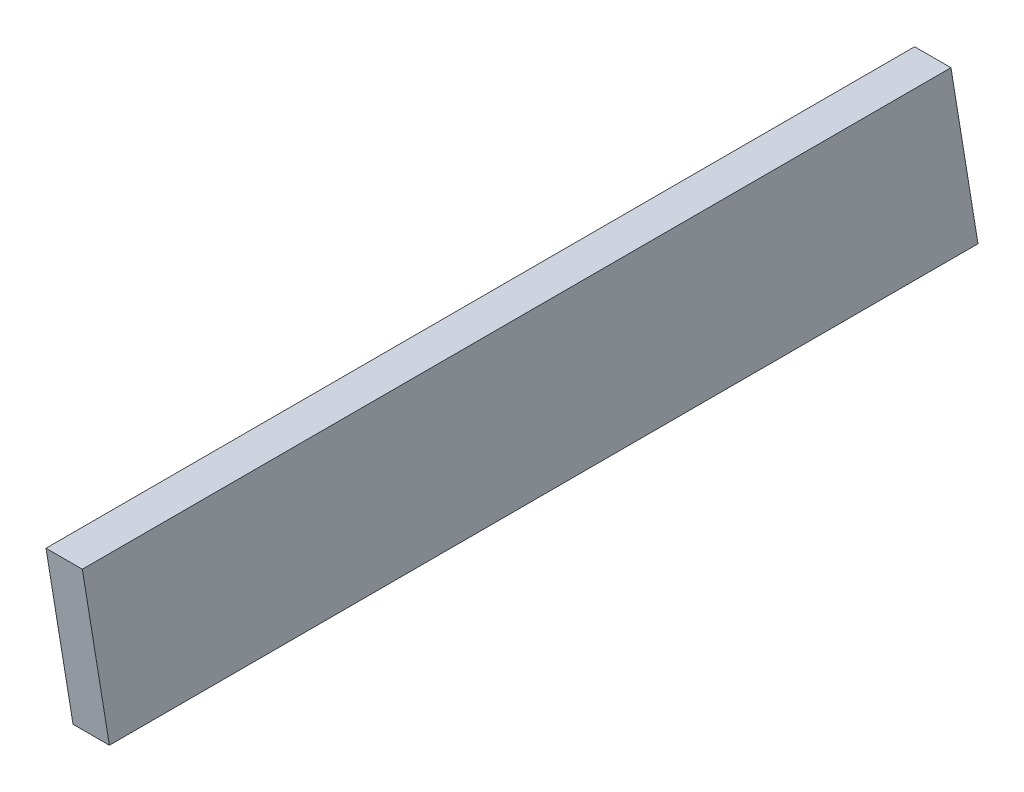
ISO-10303-21;
HEADER;
FILE_DESCRIPTION(('STEP AP214'),'2;1');
FILE_NAME('part.step','',(''),(''),'','','');
FILE_SCHEMA(('AUTOMOTIVE_DESIGN { 1 0 10303 214 1 1 1 1 }'));
ENDSEC;
DATA;
#1=APPLICATION_CONTEXT('core data for automotive mechanical design processes');
#2=APPLICATION_PROTOCOL_DEFINITION('international standard','automotive_design',2000,#1);
#3=PRODUCT_CONTEXT('',#1,'mechanical');
#4=PRODUCT('Part','Part','',(#3));
#5=PRODUCT_RELATED_PRODUCT_CATEGORY('part','',(#4));
#6=PRODUCT_DEFINITION_FORMATION('','',#4);
#7=PRODUCT_DEFINITION_CONTEXT('part definition',#1,'design');
#8=PRODUCT_DEFINITION('design','',#6,#7);
#9=PRODUCT_DEFINITION_SHAPE('','',#8);
#10=(LENGTH_UNIT() NAMED_UNIT(*) SI_UNIT(.MILLI.,.METRE.));
#11=(NAMED_UNIT(*) PLANE_ANGLE_UNIT() SI_UNIT($,.RADIAN.));
#12=(NAMED_UNIT(*) SI_UNIT($,.STERADIAN.) SOLID_ANGLE_UNIT());
#13=UNCERTAINTY_MEASURE_WITH_UNIT(LENGTH_MEASURE(1.E-05),#10,'distance_accuracy_value','');
#14=(GEOMETRIC_REPRESENTATION_CONTEXT(3) GLOBAL_UNCERTAINTY_ASSIGNED_CONTEXT((#13)) GLOBAL_UNIT_ASSIGNED_CONTEXT((#10,
#11,#12)) REPRESENTATION_CONTEXT('',''));
#15=CARTESIAN_POINT('',(0.,0.,0.));
#16=DIRECTION('',(0.,0.,1.));
#17=DIRECTION('',(1.,0.,0.));
#18=AXIS2_PLACEMENT_3D('',#15,#16,#17);
#19=CARTESIAN_POINT('',(-104.4617337346,-78.9296498973833,33.9274521196378));
#20=DIRECTION('',(0.,-0.160675602081711,0.987007269930511));
#21=DIRECTION('',(0.,-0.987007269930511,-0.160675602081711));
#22=AXIS2_PLACEMENT_3D('',#19,#20,#21);
#23=PLANE('',#22);
#24=DIRECTION('',(0.,0.98700726993051,0.160675602081711));
#25=VECTOR('',#24,1.);
#26=CARTESIAN_POINT('',(-105.1976852462,-78.9296498973833,33.9274521196378));
#27=LINE('',#26,#25);
#28=CARTESIAN_POINT('',(-105.1976852462,-78.9296498973833,33.9274521196378));
#29=VERTEX_POINT('',#28);
#30=CARTESIAN_POINT('',(-105.1976852462,-75.568618051809,34.4745968386848));
#31=VERTEX_POINT('',#30);
#32=EDGE_CURVE('E79',#29,#31,#27,.T.);
#33=ORIENTED_EDGE('',*,*,#32,.F.);
#34=DIRECTION('',(-1.,0.,0.));
#35=VECTOR('',#34,1.);
#36=CARTESIAN_POINT('',(-104.4617337346,-78.9296498973833,33.9274521196378));
#37=LINE('',#36,#35);
#38=CARTESIAN_POINT('',(-104.4617337346,-78.9296498973833,33.9274521196378));
#39=VERTEX_POINT('',#38);
#40=EDGE_CURVE('E32',#39,#29,#37,.T.);
#41=ORIENTED_EDGE('',*,*,#40,.F.);
#42=DIRECTION('',(0.,0.98700726993051,0.160675602081711));
#43=VECTOR('',#42,1.);
#44=CARTESIAN_POINT('',(-104.4617337346,-78.9296498973833,33.9274521196378));
#45=LINE('',#44,#43);
#46=CARTESIAN_POINT('',(-104.4617337346,-75.568618051809,34.4745968386848));
#47=VERTEX_POINT('',#46);
#48=EDGE_CURVE('E71',#39,#47,#45,.T.);
#49=ORIENTED_EDGE('',*,*,#48,.T.);
#50=DIRECTION('',(-1.,0.,0.));
#51=VECTOR('',#50,1.);
#52=CARTESIAN_POINT('',(-104.4617337346,-75.568618051809,34.4745968386848));
#53=LINE('',#52,#51);
#54=EDGE_CURVE('E10',#47,#31,#53,.T.);
#55=ORIENTED_EDGE('',*,*,#54,.T.);
#56=EDGE_LOOP('',(#33,#41,#49,#55));
#57=FACE_BOUND('',#56,.T.);
#58=ADVANCED_FACE('F16',(#57),#23,.T.);
#59=CARTESIAN_POINT('',(-104.4617337346,-75.568618051809,34.4745968386848));
#60=DIRECTION('',(0.,1.,0.));
#61=DIRECTION('',(-1.,0.,0.));
#62=AXIS2_PLACEMENT_3D('',#59,#60,#61);
#63=PLANE('',#62);
#64=DIRECTION('',(0.,0.,-1.));
#65=VECTOR('',#64,1.);
#66=CARTESIAN_POINT('',(-105.1976852462,-75.568618051809,34.4745968386848));
#67=LINE('',#66,#65);
#68=CARTESIAN_POINT('',(-105.1976852462,-75.568618051809,16.8867833304937));
#69=VERTEX_POINT('',#68);
#70=EDGE_CURVE('E82',#31,#69,#67,.T.);
#71=ORIENTED_EDGE('',*,*,#70,.F.);
#72=ORIENTED_EDGE('',*,*,#54,.F.);
#73=DIRECTION('',(0.,0.,-1.));
#74=VECTOR('',#73,1.);
#75=CARTESIAN_POINT('',(-104.4617337346,-75.568618051809,34.4745968386848));
#76=LINE('',#75,#74);
#77=CARTESIAN_POINT('',(-104.4617337346,-75.568618051809,16.8867833304937));
#78=VERTEX_POINT('',#77);
#79=EDGE_CURVE('E67',#47,#78,#76,.T.);
#80=ORIENTED_EDGE('',*,*,#79,.T.);
#81=DIRECTION('',(-1.,0.,0.));
#82=VECTOR('',#81,1.);
#83=CARTESIAN_POINT('',(-104.4617337346,-75.568618051809,16.8867833304937));
#84=LINE('',#83,#82);
#85=EDGE_CURVE('E24',#78,#69,#84,.T.);
#86=ORIENTED_EDGE('',*,*,#85,.T.);
#87=EDGE_LOOP('',(#71,#72,#80,#86));
#88=FACE_BOUND('',#87,.T.);
#89=ADVANCED_FACE('F68',(#88),#63,.T.);
#90=CARTESIAN_POINT('',(-104.4617337346,-75.568618051809,16.8867833304937));
#91=DIRECTION('',(0.,0.160675602081711,-0.987007269930511));
#92=DIRECTION('',(0.,0.987007269930511,0.160675602081711));
#93=AXIS2_PLACEMENT_3D('',#90,#91,#92);
#94=PLANE('',#93);
#95=DIRECTION('',(0.,-0.98700726993051,-0.160675602081711));
#96=VECTOR('',#95,1.);
#97=CARTESIAN_POINT('',(-105.1976852462,-75.568618051809,16.8867833304937));
#98=LINE('',#97,#96);
#99=CARTESIAN_POINT('',(-105.1976852462,-78.9296498973833,16.3396386114468));
#100=VERTEX_POINT('',#99);
#101=EDGE_CURVE('E65',#69,#100,#98,.T.);
#102=ORIENTED_EDGE('',*,*,#101,.F.);
#103=ORIENTED_EDGE('',*,*,#85,.F.);
#104=DIRECTION('',(0.,-0.98700726993051,-0.160675602081711));
#105=VECTOR('',#104,1.);
#106=CARTESIAN_POINT('',(-104.4617337346,-75.568618051809,16.8867833304937));
#107=LINE('',#106,#105);
#108=CARTESIAN_POINT('',(-104.4617337346,-78.9296498973833,16.3396386114468));
#109=VERTEX_POINT('',#108);
#110=EDGE_CURVE('E62',#78,#109,#107,.T.);
#111=ORIENTED_EDGE('',*,*,#110,.T.);
#112=DIRECTION('',(-1.,0.,0.));
#113=VECTOR('',#112,1.);
#114=CARTESIAN_POINT('',(-104.4617337346,-78.9296498973833,16.3396386114468));
#115=LINE('',#114,#113);
#116=EDGE_CURVE('E48',#109,#100,#115,.T.);
#117=ORIENTED_EDGE('',*,*,#116,.T.);
#118=EDGE_LOOP('',(#102,#103,#111,#117));
#119=FACE_BOUND('',#118,.T.);
#120=ADVANCED_FACE('F60',(#119),#94,.T.);
#121=CARTESIAN_POINT('',(-104.4617337346,-78.9296498973833,16.3396386114468));
#122=DIRECTION('',(0.,-1.,0.));
#123=DIRECTION('',(1.,0.,0.));
#124=AXIS2_PLACEMENT_3D('',#121,#122,#123);
#125=PLANE('',#124);
#126=DIRECTION('',(0.,0.,1.));
#127=VECTOR('',#126,1.);
#128=CARTESIAN_POINT('',(-105.1976852462,-78.9296498973833,16.3396386114468));
#129=LINE('',#128,#127);
#130=EDGE_CURVE('E85',#100,#29,#129,.T.);
#131=ORIENTED_EDGE('',*,*,#130,.F.);
#132=ORIENTED_EDGE('',*,*,#116,.F.);
#133=DIRECTION('',(0.,0.,1.));
#134=VECTOR('',#133,1.);
#135=CARTESIAN_POINT('',(-104.4617337346,-78.9296498973833,16.3396386114468));
#136=LINE('',#135,#134);
#137=EDGE_CURVE('E74',#109,#39,#136,.T.);
#138=ORIENTED_EDGE('',*,*,#137,.T.);
#139=ORIENTED_EDGE('',*,*,#40,.T.);
#140=EDGE_LOOP('',(#131,#132,#138,#139));
#141=FACE_BOUND('',#140,.T.);
#142=ADVANCED_FACE('F96',(#141),#125,.T.);
#143=CARTESIAN_POINT('',(-104.4617337346,-75.75,25.4883720930233));
#144=DIRECTION('',(-1.,0.,0.));
#145=DIRECTION('',(0.,-1.,0.));
#146=AXIS2_PLACEMENT_3D('',#143,#144,#145);
#147=PLANE('',#146);
#148=ORIENTED_EDGE('',*,*,#48,.F.);
#149=ORIENTED_EDGE('',*,*,#137,.F.);
#150=ORIENTED_EDGE('',*,*,#110,.F.);
#151=ORIENTED_EDGE('',*,*,#79,.F.);
#152=EDGE_LOOP('',(#148,#149,#150,#151));
#153=FACE_BOUND('',#152,.T.);
#154=ADVANCED_FACE('F73',(#153),#147,.F.);
#155=CARTESIAN_POINT('',(-105.1976852462,-75.75,25.4883720930233));
#156=DIRECTION('',(-1.,0.,0.));
#157=DIRECTION('',(0.,-1.,0.));
#158=AXIS2_PLACEMENT_3D('',#155,#156,#157);
#159=PLANE('',#158);
#160=ORIENTED_EDGE('',*,*,#32,.T.);
#161=ORIENTED_EDGE('',*,*,#70,.T.);
#162=ORIENTED_EDGE('',*,*,#101,.T.);
#163=ORIENTED_EDGE('',*,*,#130,.T.);
#164=EDGE_LOOP('',(#160,#161,#162,#163));
#165=FACE_BOUND('',#164,.T.);
#166=ADVANCED_FACE('F89',(#165),#159,.T.);
#167=CLOSED_SHELL('',(#58,#89,#120,#142,#154,#166));
#168=MANIFOLD_SOLID_BREP('B1',#167);
#169=ADVANCED_BREP_SHAPE_REPRESENTATION('',(#18,#168),#14);
#170=SHAPE_DEFINITION_REPRESENTATION(#9,#169);
ENDSEC;
END-ISO-10303-21;
